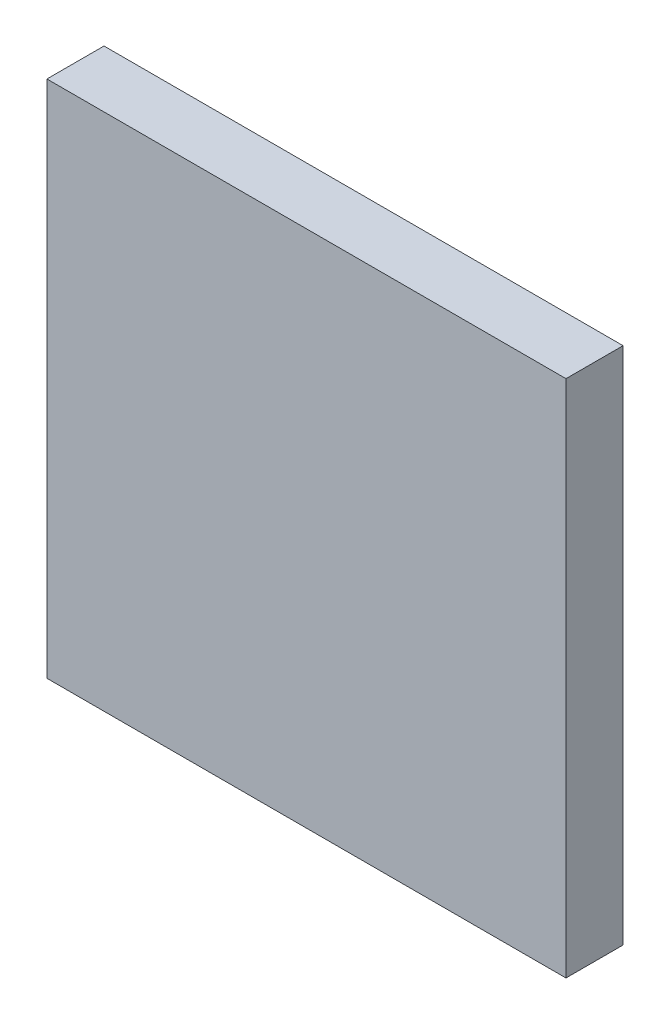
ISO-10303-21;
HEADER;
FILE_DESCRIPTION(('STEP AP214'),'2;1');
FILE_NAME('part.step','',(''),(''),'','','');
FILE_SCHEMA(('AUTOMOTIVE_DESIGN { 1 0 10303 214 1 1 1 1 }'));
ENDSEC;
DATA;
#1=APPLICATION_CONTEXT('core data for automotive mechanical design processes');
#2=APPLICATION_PROTOCOL_DEFINITION('international standard','automotive_design',2000,#1);
#3=PRODUCT_CONTEXT('',#1,'mechanical');
#4=PRODUCT('Part','Part','',(#3));
#5=PRODUCT_RELATED_PRODUCT_CATEGORY('part','',(#4));
#6=PRODUCT_DEFINITION_FORMATION('','',#4);
#7=PRODUCT_DEFINITION_CONTEXT('part definition',#1,'design');
#8=PRODUCT_DEFINITION('design','',#6,#7);
#9=PRODUCT_DEFINITION_SHAPE('','',#8);
#10=(LENGTH_UNIT() NAMED_UNIT(*) SI_UNIT(.MILLI.,.METRE.));
#11=(NAMED_UNIT(*) PLANE_ANGLE_UNIT() SI_UNIT($,.RADIAN.));
#12=(NAMED_UNIT(*) SI_UNIT($,.STERADIAN.) SOLID_ANGLE_UNIT());
#13=UNCERTAINTY_MEASURE_WITH_UNIT(LENGTH_MEASURE(1.E-05),#10,'distance_accuracy_value','');
#14=(GEOMETRIC_REPRESENTATION_CONTEXT(3) GLOBAL_UNCERTAINTY_ASSIGNED_CONTEXT((#13)) GLOBAL_UNIT_ASSIGNED_CONTEXT((#10,
#11,#12)) REPRESENTATION_CONTEXT('',''));
#15=CARTESIAN_POINT('',(0.,0.,0.));
#16=DIRECTION('',(0.,0.,1.));
#17=DIRECTION('',(1.,0.,0.));
#18=AXIS2_PLACEMENT_3D('',#15,#16,#17);
#19=CARTESIAN_POINT('',(-2.50000008,2.50000008,0.5499989));
#20=DIRECTION('',(0.,0.,-1.));
#21=DIRECTION('',(-1.,0.,0.));
#22=AXIS2_PLACEMENT_3D('',#19,#20,#21);
#23=PLANE('',#22);
#24=DIRECTION('',(1.,0.,0.));
#25=VECTOR('',#24,1.);
#26=CARTESIAN_POINT('',(-2.50000008,-2.50000008,0.5499989));
#27=LINE('',#26,#25);
#28=CARTESIAN_POINT('',(-2.50000008,-2.50000008,0.5499989));
#29=VERTEX_POINT('',#28);
#30=CARTESIAN_POINT('',(2.50000008,-2.50000008,0.5499989));
#31=VERTEX_POINT('',#30);
#32=EDGE_CURVE('E55',#29,#31,#27,.T.);
#33=ORIENTED_EDGE('',*,*,#32,.T.);
#34=DIRECTION('',(0.,1.,0.));
#35=VECTOR('',#34,1.);
#36=CARTESIAN_POINT('',(2.50000008,-2.50000008,0.5499989));
#37=LINE('',#36,#35);
#38=CARTESIAN_POINT('',(2.50000008,2.50000008,0.5499989));
#39=VERTEX_POINT('',#38);
#40=EDGE_CURVE('E57',#31,#39,#37,.T.);
#41=ORIENTED_EDGE('',*,*,#40,.T.);
#42=DIRECTION('',(1.,0.,0.));
#43=VECTOR('',#42,1.);
#44=CARTESIAN_POINT('',(2.50000008,2.50000008,0.5499989));
#45=LINE('',#44,#43);
#46=CARTESIAN_POINT('',(-2.50000008,2.50000008,0.5499989));
#47=VERTEX_POINT('',#46);
#48=EDGE_CURVE('E20',#39,#47,#45,.F.);
#49=ORIENTED_EDGE('',*,*,#48,.T.);
#50=DIRECTION('',(0.,1.,0.));
#51=VECTOR('',#50,1.);
#52=CARTESIAN_POINT('',(-2.50000008,2.50000008,0.5499989));
#53=LINE('',#52,#51);
#54=EDGE_CURVE('E80',#47,#29,#53,.F.);
#55=ORIENTED_EDGE('',*,*,#54,.T.);
#56=EDGE_LOOP('',(#33,#41,#49,#55));
#57=FACE_BOUND('',#56,.T.);
#58=ADVANCED_FACE('F17',(#57),#23,.F.);
#59=CARTESIAN_POINT('',(2.50000008,2.50000008,0.));
#60=DIRECTION('',(0.,-1.,0.));
#61=DIRECTION('',(0.,0.,-1.));
#62=AXIS2_PLACEMENT_3D('',#59,#60,#61);
#63=PLANE('',#62);
#64=DIRECTION('',(0.,0.,-1.));
#65=VECTOR('',#64,1.);
#66=CARTESIAN_POINT('',(-2.50000008,2.50000008,0.));
#67=LINE('',#66,#65);
#68=CARTESIAN_POINT('',(-2.50000008,2.50000008,0.));
#69=VERTEX_POINT('',#68);
#70=EDGE_CURVE('E68',#69,#47,#67,.F.);
#71=ORIENTED_EDGE('',*,*,#70,.T.);
#72=ORIENTED_EDGE('',*,*,#48,.F.);
#73=DIRECTION('',(0.,0.,1.));
#74=VECTOR('',#73,1.);
#75=CARTESIAN_POINT('',(2.50000008,2.50000008,0.));
#76=LINE('',#75,#74);
#77=CARTESIAN_POINT('',(2.50000008,2.50000008,0.));
#78=VERTEX_POINT('',#77);
#79=EDGE_CURVE('E63',#39,#78,#76,.F.);
#80=ORIENTED_EDGE('',*,*,#79,.T.);
#81=DIRECTION('',(-1.,0.,0.));
#82=VECTOR('',#81,1.);
#83=CARTESIAN_POINT('',(-2.50000008,2.50000008,0.));
#84=LINE('',#83,#82);
#85=EDGE_CURVE('E83',#69,#78,#84,.F.);
#86=ORIENTED_EDGE('',*,*,#85,.F.);
#87=EDGE_LOOP('',(#71,#72,#80,#86));
#88=FACE_BOUND('',#87,.T.);
#89=ADVANCED_FACE('F65',(#88),#63,.F.);
#90=CARTESIAN_POINT('',(2.50000008,-2.50000008,0.));
#91=DIRECTION('',(-1.,0.,0.));
#92=DIRECTION('',(0.,0.,1.));
#93=AXIS2_PLACEMENT_3D('',#90,#91,#92);
#94=PLANE('',#93);
#95=ORIENTED_EDGE('',*,*,#79,.F.);
#96=ORIENTED_EDGE('',*,*,#40,.F.);
#97=DIRECTION('',(0.,0.,1.));
#98=VECTOR('',#97,1.);
#99=CARTESIAN_POINT('',(2.50000008,-2.50000008,0.));
#100=LINE('',#99,#98);
#101=CARTESIAN_POINT('',(2.50000008,-2.50000008,0.));
#102=VERTEX_POINT('',#101);
#103=EDGE_CURVE('E75',#31,#102,#100,.F.);
#104=ORIENTED_EDGE('',*,*,#103,.T.);
#105=DIRECTION('',(0.,1.,0.));
#106=VECTOR('',#105,1.);
#107=CARTESIAN_POINT('',(2.50000008,2.50000008,0.));
#108=LINE('',#107,#106);
#109=EDGE_CURVE('E72',#78,#102,#108,.F.);
#110=ORIENTED_EDGE('',*,*,#109,.F.);
#111=EDGE_LOOP('',(#95,#96,#104,#110));
#112=FACE_BOUND('',#111,.T.);
#113=ADVANCED_FACE('F70',(#112),#94,.F.);
#114=CARTESIAN_POINT('',(-2.50000008,-2.50000008,0.));
#115=DIRECTION('',(0.,1.,0.));
#116=DIRECTION('',(0.,0.,1.));
#117=AXIS2_PLACEMENT_3D('',#114,#115,#116);
#118=PLANE('',#117);
#119=ORIENTED_EDGE('',*,*,#103,.F.);
#120=ORIENTED_EDGE('',*,*,#32,.F.);
#121=DIRECTION('',(0.,0.,-1.));
#122=VECTOR('',#121,1.);
#123=CARTESIAN_POINT('',(-2.50000008,-2.50000008,0.));
#124=LINE('',#123,#122);
#125=CARTESIAN_POINT('',(-2.50000008,-2.50000008,0.));
#126=VERTEX_POINT('',#125);
#127=EDGE_CURVE('E35',#29,#126,#124,.T.);
#128=ORIENTED_EDGE('',*,*,#127,.T.);
#129=DIRECTION('',(-1.,0.,0.));
#130=VECTOR('',#129,1.);
#131=CARTESIAN_POINT('',(-2.50000008,-2.50000008,0.));
#132=LINE('',#131,#130);
#133=EDGE_CURVE('E26',#102,#126,#132,.T.);
#134=ORIENTED_EDGE('',*,*,#133,.F.);
#135=EDGE_LOOP('',(#119,#120,#128,#134));
#136=FACE_BOUND('',#135,.T.);
#137=ADVANCED_FACE('F89',(#136),#118,.F.);
#138=CARTESIAN_POINT('',(-2.50000008,2.50000008,0.));
#139=DIRECTION('',(1.,0.,0.));
#140=DIRECTION('',(0.,0.,-1.));
#141=AXIS2_PLACEMENT_3D('',#138,#139,#140);
#142=PLANE('',#141);
#143=ORIENTED_EDGE('',*,*,#127,.F.);
#144=ORIENTED_EDGE('',*,*,#54,.F.);
#145=ORIENTED_EDGE('',*,*,#70,.F.);
#146=DIRECTION('',(0.,1.,0.));
#147=VECTOR('',#146,1.);
#148=CARTESIAN_POINT('',(-2.50000008,2.50000008,0.));
#149=LINE('',#148,#147);
#150=EDGE_CURVE('E11',#126,#69,#149,.T.);
#151=ORIENTED_EDGE('',*,*,#150,.F.);
#152=EDGE_LOOP('',(#143,#144,#145,#151));
#153=FACE_BOUND('',#152,.T.);
#154=ADVANCED_FACE('F91',(#153),#142,.F.);
#155=CARTESIAN_POINT('',(-2.50000008,2.50000008,0.));
#156=DIRECTION('',(0.,0.,-1.));
#157=DIRECTION('',(-1.,0.,0.));
#158=AXIS2_PLACEMENT_3D('',#155,#156,#157);
#159=PLANE('',#158);
#160=ORIENTED_EDGE('',*,*,#133,.T.);
#161=ORIENTED_EDGE('',*,*,#150,.T.);
#162=ORIENTED_EDGE('',*,*,#85,.T.);
#163=ORIENTED_EDGE('',*,*,#109,.T.);
#164=EDGE_LOOP('',(#160,#161,#162,#163));
#165=FACE_BOUND('',#164,.T.);
#166=ADVANCED_FACE('F88',(#165),#159,.T.);
#167=CLOSED_SHELL('',(#58,#89,#113,#137,#154,#166));
#168=MANIFOLD_SOLID_BREP('B1',#167);
#169=ADVANCED_BREP_SHAPE_REPRESENTATION('',(#18,#168),#14);
#170=SHAPE_DEFINITION_REPRESENTATION(#9,#169);
ENDSEC;
END-ISO-10303-21;
